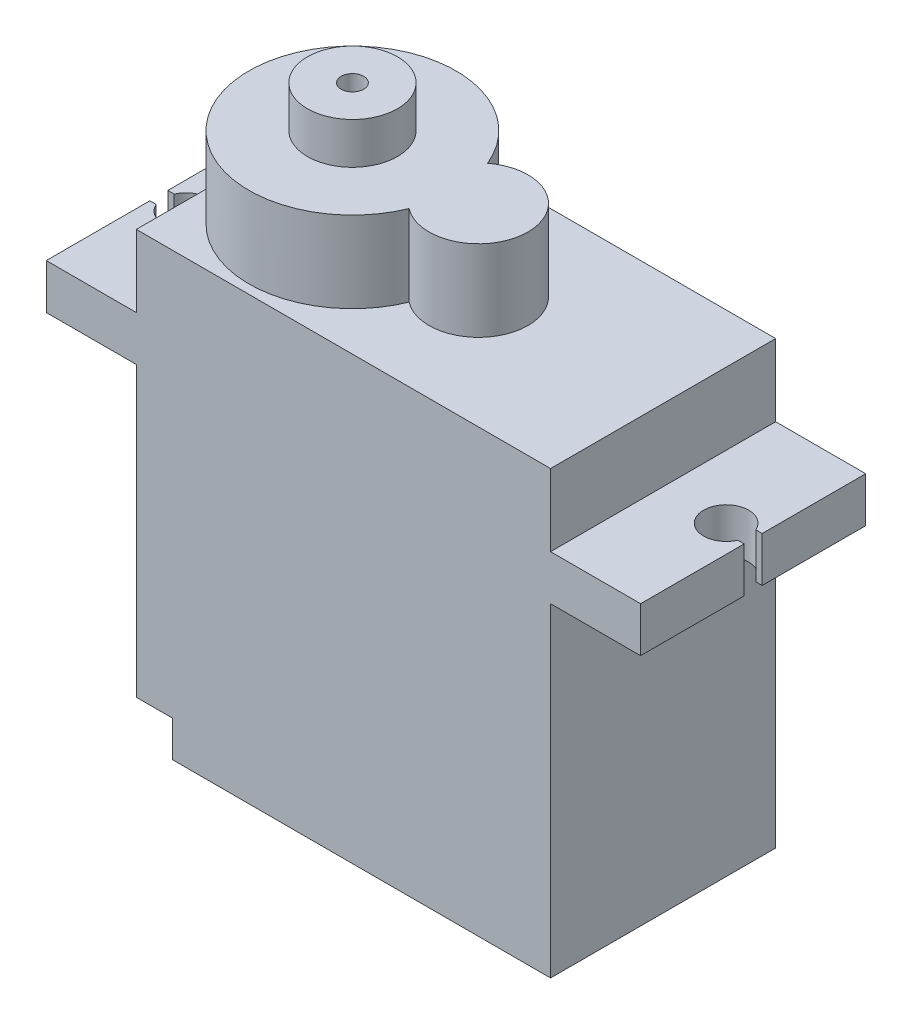
ISO-10303-21;
HEADER;
FILE_DESCRIPTION(('STEP AP214'),'2;1');
FILE_NAME('part.step','',(''),(''),'','','');
FILE_SCHEMA(('AUTOMOTIVE_DESIGN { 1 0 10303 214 1 1 1 1 }'));
ENDSEC;
DATA;
#1=APPLICATION_CONTEXT('core data for automotive mechanical design processes');
#2=APPLICATION_PROTOCOL_DEFINITION('international standard','automotive_design',2000,#1);
#3=PRODUCT_CONTEXT('',#1,'mechanical');
#4=PRODUCT('Part','Part','',(#3));
#5=PRODUCT_RELATED_PRODUCT_CATEGORY('part','',(#4));
#6=PRODUCT_DEFINITION_FORMATION('','',#4);
#7=PRODUCT_DEFINITION_CONTEXT('part definition',#1,'design');
#8=PRODUCT_DEFINITION('design','',#6,#7);
#9=PRODUCT_DEFINITION_SHAPE('','',#8);
#10=(LENGTH_UNIT() NAMED_UNIT(*) SI_UNIT(.MILLI.,.METRE.));
#11=(NAMED_UNIT(*) PLANE_ANGLE_UNIT() SI_UNIT($,.RADIAN.));
#12=(NAMED_UNIT(*) SI_UNIT($,.STERADIAN.) SOLID_ANGLE_UNIT());
#13=UNCERTAINTY_MEASURE_WITH_UNIT(LENGTH_MEASURE(1.E-05),#10,'distance_accuracy_value','');
#14=(GEOMETRIC_REPRESENTATION_CONTEXT(3) GLOBAL_UNCERTAINTY_ASSIGNED_CONTEXT((#13)) GLOBAL_UNIT_ASSIGNED_CONTEXT((#10,
#11,#12)) REPRESENTATION_CONTEXT('',''));
#15=CARTESIAN_POINT('',(0.,0.,0.));
#16=DIRECTION('',(0.,0.,1.));
#17=DIRECTION('',(1.,0.,0.));
#18=AXIS2_PLACEMENT_3D('',#15,#16,#17);
#19=CARTESIAN_POINT('',(-11.5,11.5,12.5));
#20=DIRECTION('',(0.,-1.,0.));
#21=DIRECTION('',(0.,0.,-1.));
#22=AXIS2_PLACEMENT_3D('',#19,#20,#21);
#23=PLANE('',#22);
#24=DIRECTION('',(1.,0.,0.));
#25=VECTOR('',#24,1.);
#26=CARTESIAN_POINT('',(-16.145643923739,11.5,5.75));
#27=LINE('',#26,#25);
#28=CARTESIAN_POINT('',(-16.5,11.5,5.75));
#29=VERTEX_POINT('',#28);
#30=CARTESIAN_POINT('',(-16.145643923739,11.5,5.75));
#31=VERTEX_POINT('',#30);
#32=EDGE_CURVE('E251',#29,#31,#27,.T.);
#33=ORIENTED_EDGE('',*,*,#32,.T.);
#34=CARTESIAN_POINT('',(-15.,11.5,6.25));
#35=DIRECTION('',(0.,-1.,0.));
#36=DIRECTION('',(0.,0.,1.));
#37=AXIS2_PLACEMENT_3D('',#34,#35,#36);
#38=CIRCLE('',#37,1.25);
#39=CARTESIAN_POINT('',(-16.145643923739,11.5,6.75));
#40=VERTEX_POINT('',#39);
#41=EDGE_CURVE('E246',#31,#40,#38,.T.);
#42=ORIENTED_EDGE('',*,*,#41,.T.);
#43=DIRECTION('',(-1.,0.,0.));
#44=VECTOR('',#43,1.);
#45=CARTESIAN_POINT('',(-16.145643923739,11.5,6.75));
#46=LINE('',#45,#44);
#47=CARTESIAN_POINT('',(-16.5,11.5,6.75));
#48=VERTEX_POINT('',#47);
#49=EDGE_CURVE('E254',#40,#48,#46,.T.);
#50=ORIENTED_EDGE('',*,*,#49,.T.);
#51=DIRECTION('',(0.,0.,-1.));
#52=VECTOR('',#51,1.);
#53=CARTESIAN_POINT('',(-16.5,11.5,12.5));
#54=LINE('',#53,#52);
#55=CARTESIAN_POINT('',(-16.5,11.5,12.5));
#56=VERTEX_POINT('',#55);
#57=EDGE_CURVE('E425',#56,#48,#54,.T.);
#58=ORIENTED_EDGE('',*,*,#57,.F.);
#59=DIRECTION('',(-1.,0.,0.));
#60=VECTOR('',#59,1.);
#61=CARTESIAN_POINT('',(-11.5,11.5,12.5));
#62=LINE('',#61,#60);
#63=CARTESIAN_POINT('',(-11.5,11.5,12.5));
#64=VERTEX_POINT('',#63);
#65=EDGE_CURVE('E383',#64,#56,#62,.T.);
#66=ORIENTED_EDGE('',*,*,#65,.F.);
#67=DIRECTION('',(0.,0.,-1.));
#68=VECTOR('',#67,1.);
#69=CARTESIAN_POINT('',(-11.5,11.5,12.5));
#70=LINE('',#69,#68);
#71=CARTESIAN_POINT('',(-11.5,11.5,0.));
#72=VERTEX_POINT('',#71);
#73=EDGE_CURVE('E427',#64,#72,#70,.T.);
#74=ORIENTED_EDGE('',*,*,#73,.T.);
#75=DIRECTION('',(-1.,0.,0.));
#76=VECTOR('',#75,1.);
#77=CARTESIAN_POINT('',(-11.5,11.5,0.));
#78=LINE('',#77,#76);
#79=CARTESIAN_POINT('',(-16.5,11.5,0.));
#80=VERTEX_POINT('',#79);
#81=EDGE_CURVE('E411',#72,#80,#78,.T.);
#82=ORIENTED_EDGE('',*,*,#81,.T.);
#83=EDGE_CURVE('E424',#29,#80,#54,.T.);
#84=ORIENTED_EDGE('',*,*,#83,.F.);
#85=EDGE_LOOP('',(#33,#42,#50,#58,#66,#74,#82,#84));
#86=FACE_BOUND('',#85,.T.);
#87=ADVANCED_FACE('F43',(#86),#23,.F.);
#88=CARTESIAN_POINT('',(-16.5,9.,12.5));
#89=DIRECTION('',(1.,0.,0.));
#90=DIRECTION('',(0.,0.,-1.));
#91=AXIS2_PLACEMENT_3D('',#88,#89,#90);
#92=PLANE('',#91);
#93=DIRECTION('',(0.,-1.,0.));
#94=VECTOR('',#93,1.);
#95=CARTESIAN_POINT('',(-16.5,9.,5.75));
#96=LINE('',#95,#94);
#97=CARTESIAN_POINT('',(-16.5,9.,5.75));
#98=VERTEX_POINT('',#97);
#99=EDGE_CURVE('E270',#29,#98,#96,.T.);
#100=ORIENTED_EDGE('',*,*,#99,.F.);
#101=ORIENTED_EDGE('',*,*,#83,.T.);
#102=DIRECTION('',(0.,-1.,0.));
#103=VECTOR('',#102,1.);
#104=CARTESIAN_POINT('',(-16.5,9.,0.));
#105=LINE('',#104,#103);
#106=CARTESIAN_POINT('',(-16.5,9.,0.));
#107=VERTEX_POINT('',#106);
#108=EDGE_CURVE('E414',#80,#107,#105,.T.);
#109=ORIENTED_EDGE('',*,*,#108,.T.);
#110=DIRECTION('',(0.,0.,-1.));
#111=VECTOR('',#110,1.);
#112=CARTESIAN_POINT('',(-16.5,9.,12.5));
#113=LINE('',#112,#111);
#114=EDGE_CURVE('E420',#98,#107,#113,.T.);
#115=ORIENTED_EDGE('',*,*,#114,.F.);
#116=EDGE_LOOP('',(#100,#101,#109,#115));
#117=FACE_BOUND('',#116,.T.);
#118=ADVANCED_FACE('F506',(#117),#92,.F.);
#119=DIRECTION('',(0.,1.,0.));
#120=VECTOR('',#119,1.);
#121=CARTESIAN_POINT('',(-16.5,9.,6.75));
#122=LINE('',#121,#120);
#123=CARTESIAN_POINT('',(-16.5,9.,6.75));
#124=VERTEX_POINT('',#123);
#125=EDGE_CURVE('E257',#124,#48,#122,.T.);
#126=ORIENTED_EDGE('',*,*,#125,.F.);
#127=CARTESIAN_POINT('',(-16.5,9.,12.5));
#128=VERTEX_POINT('',#127);
#129=EDGE_CURVE('E421',#128,#124,#113,.T.);
#130=ORIENTED_EDGE('',*,*,#129,.F.);
#131=DIRECTION('',(0.,-1.,0.));
#132=VECTOR('',#131,1.);
#133=CARTESIAN_POINT('',(-16.5,9.,12.5));
#134=LINE('',#133,#132);
#135=EDGE_CURVE('E385',#56,#128,#134,.T.);
#136=ORIENTED_EDGE('',*,*,#135,.F.);
#137=ORIENTED_EDGE('',*,*,#57,.T.);
#138=EDGE_LOOP('',(#126,#130,#136,#137));
#139=FACE_BOUND('',#138,.T.);
#140=ADVANCED_FACE('F480',(#139),#92,.F.);
#141=CARTESIAN_POINT('',(-11.5,9.,12.5));
#142=DIRECTION('',(0.,1.,0.));
#143=DIRECTION('',(0.,0.,1.));
#144=AXIS2_PLACEMENT_3D('',#141,#142,#143);
#145=PLANE('',#144);
#146=DIRECTION('',(1.,0.,0.));
#147=VECTOR('',#146,1.);
#148=CARTESIAN_POINT('',(-11.5,9.,5.75));
#149=LINE('',#148,#147);
#150=CARTESIAN_POINT('',(-16.145643923739,9.,5.75));
#151=VERTEX_POINT('',#150);
#152=EDGE_CURVE('E11',#98,#151,#149,.T.);
#153=ORIENTED_EDGE('',*,*,#152,.F.);
#154=ORIENTED_EDGE('',*,*,#114,.T.);
#155=DIRECTION('',(1.,0.,0.));
#156=VECTOR('',#155,1.);
#157=CARTESIAN_POINT('',(-11.5,9.,0.));
#158=LINE('',#157,#156);
#159=CARTESIAN_POINT('',(-11.5,9.,0.));
#160=VERTEX_POINT('',#159);
#161=EDGE_CURVE('E367',#107,#160,#158,.T.);
#162=ORIENTED_EDGE('',*,*,#161,.T.);
#163=DIRECTION('',(0.,0.,-1.));
#164=VECTOR('',#163,1.);
#165=CARTESIAN_POINT('',(-11.5,9.,12.5));
#166=LINE('',#165,#164);
#167=CARTESIAN_POINT('',(-11.5,9.,12.5));
#168=VERTEX_POINT('',#167);
#169=EDGE_CURVE('E389',#168,#160,#166,.T.);
#170=ORIENTED_EDGE('',*,*,#169,.F.);
#171=DIRECTION('',(1.,0.,0.));
#172=VECTOR('',#171,1.);
#173=CARTESIAN_POINT('',(-11.5,9.,12.5));
#174=LINE('',#173,#172);
#175=EDGE_CURVE('E387',#128,#168,#174,.T.);
#176=ORIENTED_EDGE('',*,*,#175,.F.);
#177=ORIENTED_EDGE('',*,*,#129,.T.);
#178=DIRECTION('',(-1.,0.,0.));
#179=VECTOR('',#178,1.);
#180=CARTESIAN_POINT('',(-11.5,9.,6.75));
#181=LINE('',#180,#179);
#182=CARTESIAN_POINT('',(-16.145643923739,9.,6.75));
#183=VERTEX_POINT('',#182);
#184=EDGE_CURVE('E476',#183,#124,#181,.T.);
#185=ORIENTED_EDGE('',*,*,#184,.F.);
#186=CARTESIAN_POINT('',(-15.,9.,6.25));
#187=DIRECTION('',(0.,1.,0.));
#188=DIRECTION('',(0.,0.,1.));
#189=AXIS2_PLACEMENT_3D('',#186,#187,#188);
#190=CIRCLE('',#189,1.25);
#191=EDGE_CURVE('E52',#151,#183,#190,.F.);
#192=ORIENTED_EDGE('',*,*,#191,.F.);
#193=EDGE_LOOP('',(#153,#154,#162,#170,#176,#177,#185,#192));
#194=FACE_BOUND('',#193,.T.);
#195=ADVANCED_FACE('F484',(#194),#145,.F.);
#196=CARTESIAN_POINT('',(16.5,9.,12.5));
#197=DIRECTION('',(-1.,0.,0.));
#198=DIRECTION('',(0.,0.,1.));
#199=AXIS2_PLACEMENT_3D('',#196,#197,#198);
#200=PLANE('',#199);
#201=DIRECTION('',(0.,0.,-1.));
#202=VECTOR('',#201,1.);
#203=CARTESIAN_POINT('',(16.5,9.,12.5));
#204=LINE('',#203,#202);
#205=CARTESIAN_POINT('',(16.5,9.,12.5));
#206=VERTEX_POINT('',#205);
#207=CARTESIAN_POINT('',(16.5,9.,6.75));
#208=VERTEX_POINT('',#207);
#209=EDGE_CURVE('E445',#206,#208,#204,.T.);
#210=ORIENTED_EDGE('',*,*,#209,.T.);
#211=DIRECTION('',(0.,1.,0.));
#212=VECTOR('',#211,1.);
#213=CARTESIAN_POINT('',(16.5,9.,6.75));
#214=LINE('',#213,#212);
#215=CARTESIAN_POINT('',(16.5,11.5,6.75));
#216=VERTEX_POINT('',#215);
#217=EDGE_CURVE('E288',#208,#216,#214,.T.);
#218=ORIENTED_EDGE('',*,*,#217,.T.);
#219=DIRECTION('',(0.,0.,-1.));
#220=VECTOR('',#219,1.);
#221=CARTESIAN_POINT('',(16.5,11.5,12.5));
#222=LINE('',#221,#220);
#223=CARTESIAN_POINT('',(16.5,11.5,12.5));
#224=VERTEX_POINT('',#223);
#225=EDGE_CURVE('E441',#224,#216,#222,.T.);
#226=ORIENTED_EDGE('',*,*,#225,.F.);
#227=DIRECTION('',(0.,1.,0.));
#228=VECTOR('',#227,1.);
#229=CARTESIAN_POINT('',(16.5,9.,12.5));
#230=LINE('',#229,#228);
#231=EDGE_CURVE('E373',#206,#224,#230,.T.);
#232=ORIENTED_EDGE('',*,*,#231,.F.);
#233=EDGE_LOOP('',(#210,#218,#226,#232));
#234=FACE_BOUND('',#233,.T.);
#235=ADVANCED_FACE('F553',(#234),#200,.F.);
#236=CARTESIAN_POINT('',(-9.50000000000001,-9.,12.5));
#237=DIRECTION('',(0.707106781186549,0.707106781186546,0.));
#238=DIRECTION('',(0.,0.,-1.));
#239=AXIS2_PLACEMENT_3D('',#236,#237,#238);
#240=PLANE('',#239);
#241=DIRECTION('',(0.707106781186546,-0.707106781186549,0.));
#242=VECTOR('',#241,1.);
#243=CARTESIAN_POINT('',(-9.50000000000001,-9.,2.));
#244=LINE('',#243,#242);
#245=CARTESIAN_POINT('',(-9.50000000000001,-9.,2.));
#246=VERTEX_POINT('',#245);
#247=CARTESIAN_POINT('',(-11.5,-7.,2.));
#248=VERTEX_POINT('',#247);
#249=EDGE_CURVE('E472',#246,#248,#244,.F.);
#250=ORIENTED_EDGE('',*,*,#249,.F.);
#251=DIRECTION('',(0.,0.,-1.));
#252=VECTOR('',#251,1.);
#253=CARTESIAN_POINT('',(-9.50000000000001,-9.,12.5));
#254=LINE('',#253,#252);
#255=CARTESIAN_POINT('',(-9.50000000000001,-9.,4.35));
#256=VERTEX_POINT('',#255);
#257=EDGE_CURVE('E459',#256,#246,#254,.T.);
#258=ORIENTED_EDGE('',*,*,#257,.F.);
#259=DIRECTION('',(-0.707106781186546,0.707106781186549,0.));
#260=VECTOR('',#259,1.);
#261=CARTESIAN_POINT('',(-9.50000000000001,-9.,4.35));
#262=LINE('',#261,#260);
#263=CARTESIAN_POINT('',(-11.5,-7.,4.35));
#264=VERTEX_POINT('',#263);
#265=EDGE_CURVE('E466',#264,#256,#262,.F.);
#266=ORIENTED_EDGE('',*,*,#265,.F.);
#267=DIRECTION('',(0.,0.,1.));
#268=VECTOR('',#267,1.);
#269=CARTESIAN_POINT('',(-11.5,-7.00000000000001,12.5));
#270=LINE('',#269,#268);
#271=EDGE_CURVE('E464',#248,#264,#270,.T.);
#272=ORIENTED_EDGE('',*,*,#271,.F.);
#273=EDGE_LOOP('',(#250,#258,#266,#272));
#274=FACE_BOUND('',#273,.T.);
#275=ADVANCED_FACE('F694',(#274),#240,.F.);
#276=CARTESIAN_POINT('',(-11.5,9.,12.5));
#277=DIRECTION('',(1.,0.,0.));
#278=DIRECTION('',(0.,1.,0.));
#279=AXIS2_PLACEMENT_3D('',#276,#277,#278);
#280=PLANE('',#279);
#281=DIRECTION('',(0.,-1.,0.));
#282=VECTOR('',#281,1.);
#283=CARTESIAN_POINT('',(-11.5,9.,0.));
#284=LINE('',#283,#282);
#285=CARTESIAN_POINT('',(-11.5,-7.,0.));
#286=VERTEX_POINT('',#285);
#287=EDGE_CURVE('E362',#160,#286,#284,.T.);
#288=ORIENTED_EDGE('',*,*,#287,.T.);
#289=EDGE_CURVE('E460',#286,#248,#270,.T.);
#290=ORIENTED_EDGE('',*,*,#289,.T.);
#291=ORIENTED_EDGE('',*,*,#271,.T.);
#292=DIRECTION('',(0.,0.,-1.));
#293=VECTOR('',#292,1.);
#294=CARTESIAN_POINT('',(-11.5,-7.,8.15));
#295=LINE('',#294,#293);
#296=CARTESIAN_POINT('',(-11.5,-7.,8.15));
#297=VERTEX_POINT('',#296);
#298=EDGE_CURVE('E335',#297,#264,#295,.T.);
#299=ORIENTED_EDGE('',*,*,#298,.F.);
#300=CARTESIAN_POINT('',(-11.5,-7.,10.5));
#301=VERTEX_POINT('',#300);
#302=EDGE_CURVE('E457',#297,#301,#270,.T.);
#303=ORIENTED_EDGE('',*,*,#302,.T.);
#304=DIRECTION('',(0.,0.,-1.));
#305=VECTOR('',#304,1.);
#306=CARTESIAN_POINT('',(-11.5,-7.,12.5));
#307=LINE('',#306,#305);
#308=CARTESIAN_POINT('',(-11.5,-7.,12.5));
#309=VERTEX_POINT('',#308);
#310=EDGE_CURVE('E313',#309,#301,#307,.T.);
#311=ORIENTED_EDGE('',*,*,#310,.F.);
#312=DIRECTION('',(0.,-1.,0.));
#313=VECTOR('',#312,1.);
#314=CARTESIAN_POINT('',(-11.5,9.,12.5));
#315=LINE('',#314,#313);
#316=EDGE_CURVE('E363',#168,#309,#315,.T.);
#317=ORIENTED_EDGE('',*,*,#316,.F.);
#318=ORIENTED_EDGE('',*,*,#169,.T.);
#319=EDGE_LOOP('',(#288,#290,#291,#299,#303,#311,#317,#318));
#320=FACE_BOUND('',#319,.T.);
#321=ADVANCED_FACE('F510',(#320),#280,.F.);
#322=CARTESIAN_POINT('',(11.5,-9.,12.5));
#323=DIRECTION('',(0.,1.,0.));
#324=DIRECTION('',(-1.,0.,0.));
#325=AXIS2_PLACEMENT_3D('',#322,#323,#324);
#326=PLANE('',#325);
#327=DIRECTION('',(1.,0.,0.));
#328=VECTOR('',#327,1.);
#329=CARTESIAN_POINT('',(11.5,-9.,12.5));
#330=LINE('',#329,#328);
#331=CARTESIAN_POINT('',(-9.50000000000001,-9.,12.5));
#332=VERTEX_POINT('',#331);
#333=CARTESIAN_POINT('',(11.5,-9.,12.5));
#334=VERTEX_POINT('',#333);
#335=EDGE_CURVE('E366',#332,#334,#330,.T.);
#336=ORIENTED_EDGE('',*,*,#335,.F.);
#337=CARTESIAN_POINT('',(-9.50000000000001,-9.,10.5));
#338=VERTEX_POINT('',#337);
#339=EDGE_CURVE('E454',#332,#338,#254,.T.);
#340=ORIENTED_EDGE('',*,*,#339,.T.);
#341=CARTESIAN_POINT('',(-9.50000000000001,-9.,8.15));
#342=VERTEX_POINT('',#341);
#343=EDGE_CURVE('E458',#338,#342,#254,.T.);
#344=ORIENTED_EDGE('',*,*,#343,.T.);
#345=DIRECTION('',(0.,0.,1.));
#346=VECTOR('',#345,1.);
#347=CARTESIAN_POINT('',(-9.50000000000001,-9.,8.15));
#348=LINE('',#347,#346);
#349=EDGE_CURVE('E294',#256,#342,#348,.T.);
#350=ORIENTED_EDGE('',*,*,#349,.F.);
#351=ORIENTED_EDGE('',*,*,#257,.T.);
#352=DIRECTION('',(0.,0.,1.));
#353=VECTOR('',#352,1.);
#354=CARTESIAN_POINT('',(-9.50000000000001,-9.,0.));
#355=LINE('',#354,#353);
#356=CARTESIAN_POINT('',(-9.50000000000001,-9.,0.));
#357=VERTEX_POINT('',#356);
#358=EDGE_CURVE('E299',#357,#246,#355,.T.);
#359=ORIENTED_EDGE('',*,*,#358,.F.);
#360=DIRECTION('',(1.,0.,0.));
#361=VECTOR('',#360,1.);
#362=CARTESIAN_POINT('',(11.5,-9.,0.));
#363=LINE('',#362,#361);
#364=CARTESIAN_POINT('',(11.5,-9.,0.));
#365=VERTEX_POINT('',#364);
#366=EDGE_CURVE('E392',#357,#365,#363,.T.);
#367=ORIENTED_EDGE('',*,*,#366,.T.);
#368=DIRECTION('',(0.,0.,-1.));
#369=VECTOR('',#368,1.);
#370=CARTESIAN_POINT('',(11.5,-9.,12.5));
#371=LINE('',#370,#369);
#372=EDGE_CURVE('E451',#334,#365,#371,.T.);
#373=ORIENTED_EDGE('',*,*,#372,.F.);
#374=EDGE_LOOP('',(#336,#340,#344,#350,#351,#359,#367,#373));
#375=FACE_BOUND('',#374,.T.);
#376=ADVANCED_FACE('F539',(#375),#326,.F.);
#377=CARTESIAN_POINT('',(11.5,9.,12.5));
#378=DIRECTION('',(-1.,0.,0.));
#379=DIRECTION('',(0.,-1.,0.));
#380=AXIS2_PLACEMENT_3D('',#377,#378,#379);
#381=PLANE('',#380);
#382=DIRECTION('',(0.,1.,0.));
#383=VECTOR('',#382,1.);
#384=CARTESIAN_POINT('',(11.5,9.,0.));
#385=LINE('',#384,#383);
#386=CARTESIAN_POINT('',(11.5,9.,0.));
#387=VERTEX_POINT('',#386);
#388=EDGE_CURVE('E394',#365,#387,#385,.T.);
#389=ORIENTED_EDGE('',*,*,#388,.T.);
#390=DIRECTION('',(0.,0.,-1.));
#391=VECTOR('',#390,1.);
#392=CARTESIAN_POINT('',(11.5,9.,12.5));
#393=LINE('',#392,#391);
#394=CARTESIAN_POINT('',(11.5,9.,12.5));
#395=VERTEX_POINT('',#394);
#396=EDGE_CURVE('E448',#395,#387,#393,.T.);
#397=ORIENTED_EDGE('',*,*,#396,.F.);
#398=DIRECTION('',(0.,1.,0.));
#399=VECTOR('',#398,1.);
#400=CARTESIAN_POINT('',(11.5,9.,12.5));
#401=LINE('',#400,#399);
#402=EDGE_CURVE('E369',#334,#395,#401,.T.);
#403=ORIENTED_EDGE('',*,*,#402,.F.);
#404=ORIENTED_EDGE('',*,*,#372,.T.);
#405=EDGE_LOOP('',(#389,#397,#403,#404));
#406=FACE_BOUND('',#405,.T.);
#407=ADVANCED_FACE('F545',(#406),#381,.F.);
#408=CARTESIAN_POINT('',(11.5,9.,12.5));
#409=DIRECTION('',(0.,1.,0.));
#410=DIRECTION('',(-1.,0.,0.));
#411=AXIS2_PLACEMENT_3D('',#408,#409,#410);
#412=PLANE('',#411);
#413=CARTESIAN_POINT('',(15.,9.,6.25));
#414=DIRECTION('',(0.,1.,0.));
#415=DIRECTION('',(-1.,0.,0.));
#416=AXIS2_PLACEMENT_3D('',#413,#414,#415);
#417=CIRCLE('',#416,1.25);
#418=CARTESIAN_POINT('',(16.145643923739,9.,5.75));
#419=VERTEX_POINT('',#418);
#420=CARTESIAN_POINT('',(16.145643923739,9.,6.75));
#421=VERTEX_POINT('',#420);
#422=EDGE_CURVE('E285',#419,#421,#417,.T.);
#423=ORIENTED_EDGE('',*,*,#422,.T.);
#424=DIRECTION('',(1.,0.,0.));
#425=VECTOR('',#424,1.);
#426=CARTESIAN_POINT('',(11.5,9.,6.75));
#427=LINE('',#426,#425);
#428=EDGE_CURVE('E291',#421,#208,#427,.T.);
#429=ORIENTED_EDGE('',*,*,#428,.T.);
#430=ORIENTED_EDGE('',*,*,#209,.F.);
#431=DIRECTION('',(1.,0.,0.));
#432=VECTOR('',#431,1.);
#433=CARTESIAN_POINT('',(11.5,9.,12.5));
#434=LINE('',#433,#432);
#435=EDGE_CURVE('E371',#395,#206,#434,.T.);
#436=ORIENTED_EDGE('',*,*,#435,.F.);
#437=ORIENTED_EDGE('',*,*,#396,.T.);
#438=DIRECTION('',(1.,0.,0.));
#439=VECTOR('',#438,1.);
#440=CARTESIAN_POINT('',(11.5,9.,0.));
#441=LINE('',#440,#439);
#442=CARTESIAN_POINT('',(16.5,9.,0.));
#443=VERTEX_POINT('',#442);
#444=EDGE_CURVE('E396',#387,#443,#441,.T.);
#445=ORIENTED_EDGE('',*,*,#444,.T.);
#446=CARTESIAN_POINT('',(16.5,9.,5.75));
#447=VERTEX_POINT('',#446);
#448=EDGE_CURVE('E444',#447,#443,#204,.T.);
#449=ORIENTED_EDGE('',*,*,#448,.F.);
#450=DIRECTION('',(-1.,0.,0.));
#451=VECTOR('',#450,1.);
#452=CARTESIAN_POINT('',(11.5,9.,5.75));
#453=LINE('',#452,#451);
#454=EDGE_CURVE('E282',#447,#419,#453,.T.);
#455=ORIENTED_EDGE('',*,*,#454,.T.);
#456=EDGE_LOOP('',(#423,#429,#430,#436,#437,#445,#449,#455));
#457=FACE_BOUND('',#456,.T.);
#458=ADVANCED_FACE('F551',(#457),#412,.F.);
#459=CARTESIAN_POINT('',(16.5,11.5,5.75));
#460=VERTEX_POINT('',#459);
#461=CARTESIAN_POINT('',(16.5,11.5,0.));
#462=VERTEX_POINT('',#461);
#463=EDGE_CURVE('E440',#460,#462,#222,.T.);
#464=ORIENTED_EDGE('',*,*,#463,.F.);
#465=DIRECTION('',(0.,-1.,0.));
#466=VECTOR('',#465,1.);
#467=CARTESIAN_POINT('',(16.5,9.,5.75));
#468=LINE('',#467,#466);
#469=EDGE_CURVE('E67',#460,#447,#468,.T.);
#470=ORIENTED_EDGE('',*,*,#469,.T.);
#471=ORIENTED_EDGE('',*,*,#448,.T.);
#472=DIRECTION('',(0.,1.,0.));
#473=VECTOR('',#472,1.);
#474=CARTESIAN_POINT('',(16.5,9.,0.));
#475=LINE('',#474,#473);
#476=EDGE_CURVE('E399',#443,#462,#475,.T.);
#477=ORIENTED_EDGE('',*,*,#476,.T.);
#478=EDGE_LOOP('',(#464,#470,#471,#477));
#479=FACE_BOUND('',#478,.T.);
#480=ADVANCED_FACE('F701',(#479),#200,.F.);
#481=CARTESIAN_POINT('',(11.5,11.5,12.5));
#482=DIRECTION('',(0.,-1.,0.));
#483=DIRECTION('',(0.,0.,-1.));
#484=AXIS2_PLACEMENT_3D('',#481,#482,#483);
#485=PLANE('',#484);
#486=ORIENTED_EDGE('',*,*,#225,.T.);
#487=DIRECTION('',(1.,0.,0.));
#488=VECTOR('',#487,1.);
#489=CARTESIAN_POINT('',(16.145643923739,11.5,6.75));
#490=LINE('',#489,#488);
#491=CARTESIAN_POINT('',(16.145643923739,11.5,6.75));
#492=VERTEX_POINT('',#491);
#493=EDGE_CURVE('E275',#492,#216,#490,.T.);
#494=ORIENTED_EDGE('',*,*,#493,.F.);
#495=CARTESIAN_POINT('',(15.,11.5,6.25));
#496=DIRECTION('',(0.,1.,0.));
#497=DIRECTION('',(0.,0.,1.));
#498=AXIS2_PLACEMENT_3D('',#495,#496,#497);
#499=CIRCLE('',#498,1.25);
#500=CARTESIAN_POINT('',(16.145643923739,11.5,5.75));
#501=VERTEX_POINT('',#500);
#502=EDGE_CURVE('E272',#501,#492,#499,.T.);
#503=ORIENTED_EDGE('',*,*,#502,.F.);
#504=DIRECTION('',(1.,0.,0.));
#505=VECTOR('',#504,1.);
#506=CARTESIAN_POINT('',(11.5,11.5,5.75));
#507=LINE('',#506,#505);
#508=EDGE_CURVE('E474',#501,#460,#507,.T.);
#509=ORIENTED_EDGE('',*,*,#508,.T.);
#510=ORIENTED_EDGE('',*,*,#463,.T.);
#511=DIRECTION('',(-1.,0.,0.));
#512=VECTOR('',#511,1.);
#513=CARTESIAN_POINT('',(11.5,11.5,0.));
#514=LINE('',#513,#512);
#515=CARTESIAN_POINT('',(11.5,11.5,0.));
#516=VERTEX_POINT('',#515);
#517=EDGE_CURVE('E402',#462,#516,#514,.T.);
#518=ORIENTED_EDGE('',*,*,#517,.T.);
#519=DIRECTION('',(0.,0.,-1.));
#520=VECTOR('',#519,1.);
#521=CARTESIAN_POINT('',(11.5,11.5,12.5));
#522=LINE('',#521,#520);
#523=CARTESIAN_POINT('',(11.5,11.5,12.5));
#524=VERTEX_POINT('',#523);
#525=EDGE_CURVE('E437',#524,#516,#522,.T.);
#526=ORIENTED_EDGE('',*,*,#525,.F.);
#527=DIRECTION('',(-1.,0.,0.));
#528=VECTOR('',#527,1.);
#529=CARTESIAN_POINT('',(11.5,11.5,12.5));
#530=LINE('',#529,#528);
#531=EDGE_CURVE('E375',#224,#524,#530,.T.);
#532=ORIENTED_EDGE('',*,*,#531,.F.);
#533=EDGE_LOOP('',(#486,#494,#503,#509,#510,#518,#526,#532));
#534=FACE_BOUND('',#533,.T.);
#535=ADVANCED_FACE('F558',(#534),#485,.F.);
#536=CARTESIAN_POINT('',(11.5,11.5,12.5));
#537=DIRECTION('',(-1.,0.,0.));
#538=DIRECTION('',(0.,0.,1.));
#539=AXIS2_PLACEMENT_3D('',#536,#537,#538);
#540=PLANE('',#539);
#541=DIRECTION('',(0.,1.,0.));
#542=VECTOR('',#541,1.);
#543=CARTESIAN_POINT('',(11.5,11.5,0.));
#544=LINE('',#543,#542);
#545=CARTESIAN_POINT('',(11.5,15.5,0.));
#546=VERTEX_POINT('',#545);
#547=EDGE_CURVE('E404',#516,#546,#544,.T.);
#548=ORIENTED_EDGE('',*,*,#547,.T.);
#549=DIRECTION('',(0.,0.,-1.));
#550=VECTOR('',#549,1.);
#551=CARTESIAN_POINT('',(11.5,15.5,12.5));
#552=LINE('',#551,#550);
#553=CARTESIAN_POINT('',(11.5,15.5,12.5));
#554=VERTEX_POINT('',#553);
#555=EDGE_CURVE('E434',#554,#546,#552,.T.);
#556=ORIENTED_EDGE('',*,*,#555,.F.);
#557=DIRECTION('',(0.,1.,0.));
#558=VECTOR('',#557,1.);
#559=CARTESIAN_POINT('',(11.5,11.5,12.5));
#560=LINE('',#559,#558);
#561=EDGE_CURVE('E377',#524,#554,#560,.T.);
#562=ORIENTED_EDGE('',*,*,#561,.F.);
#563=ORIENTED_EDGE('',*,*,#525,.T.);
#564=EDGE_LOOP('',(#548,#556,#562,#563));
#565=FACE_BOUND('',#564,.T.);
#566=ADVANCED_FACE('F564',(#565),#540,.F.);
#567=CARTESIAN_POINT('',(-11.5,15.5,12.5));
#568=DIRECTION('',(0.,-1.,0.));
#569=DIRECTION('',(0.,0.,-1.));
#570=AXIS2_PLACEMENT_3D('',#567,#568,#569);
#571=PLANE('',#570);
#572=CARTESIAN_POINT('',(1.25,15.5,6.25));
#573=DIRECTION('',(0.,1.,0.));
#574=DIRECTION('',(0.,0.,1.));
#575=AXIS2_PLACEMENT_3D('',#572,#573,#574);
#576=CIRCLE('',#575,2.75);
#577=CARTESIAN_POINT('',(-0.42857142857143,15.5,8.42827866885384));
#578=VERTEX_POINT('',#577);
#579=CARTESIAN_POINT('',(-0.42857142857143,15.5,4.07172133114616));
#580=VERTEX_POINT('',#579);
#581=EDGE_CURVE('E311',#578,#580,#576,.T.);
#582=ORIENTED_EDGE('',*,*,#581,.F.);
#583=CARTESIAN_POINT('',(-5.75,15.5,6.25));
#584=DIRECTION('',(0.,1.,0.));
#585=DIRECTION('',(0.,0.,1.));
#586=AXIS2_PLACEMENT_3D('',#583,#584,#585);
#587=CIRCLE('',#586,5.75);
#588=CARTESIAN_POINT('',(-11.5,15.5,6.25));
#589=VERTEX_POINT('',#588);
#590=EDGE_CURVE('E356',#589,#578,#587,.T.);
#591=ORIENTED_EDGE('',*,*,#590,.F.);
#592=DIRECTION('',(0.,0.,-1.));
#593=VECTOR('',#592,1.);
#594=CARTESIAN_POINT('',(-11.5,15.5,12.5));
#595=LINE('',#594,#593);
#596=CARTESIAN_POINT('',(-11.5,15.5,12.5));
#597=VERTEX_POINT('',#596);
#598=EDGE_CURVE('E431',#597,#589,#595,.T.);
#599=ORIENTED_EDGE('',*,*,#598,.F.);
#600=DIRECTION('',(-1.,0.,0.));
#601=VECTOR('',#600,1.);
#602=CARTESIAN_POINT('',(-11.5,15.5,12.5));
#603=LINE('',#602,#601);
#604=EDGE_CURVE('E379',#554,#597,#603,.T.);
#605=ORIENTED_EDGE('',*,*,#604,.F.);
#606=ORIENTED_EDGE('',*,*,#555,.T.);
#607=DIRECTION('',(-1.,0.,0.));
#608=VECTOR('',#607,1.);
#609=CARTESIAN_POINT('',(-11.5,15.5,0.));
#610=LINE('',#609,#608);
#611=CARTESIAN_POINT('',(-11.5,15.5,0.));
#612=VERTEX_POINT('',#611);
#613=EDGE_CURVE('E406',#546,#612,#610,.T.);
#614=ORIENTED_EDGE('',*,*,#613,.T.);
#615=EDGE_CURVE('E430',#589,#612,#595,.T.);
#616=ORIENTED_EDGE('',*,*,#615,.F.);
#617=EDGE_CURVE('E349',#580,#589,#587,.T.);
#618=ORIENTED_EDGE('',*,*,#617,.F.);
#619=EDGE_LOOP('',(#582,#591,#599,#605,#606,#614,#616,#618));
#620=FACE_BOUND('',#619,.T.);
#621=ADVANCED_FACE('F567',(#620),#571,.F.);
#622=CARTESIAN_POINT('',(-11.5,11.5,12.5));
#623=DIRECTION('',(1.,0.,0.));
#624=DIRECTION('',(0.,0.,-1.));
#625=AXIS2_PLACEMENT_3D('',#622,#623,#624);
#626=PLANE('',#625);
#627=DIRECTION('',(0.,-1.,0.));
#628=VECTOR('',#627,1.);
#629=CARTESIAN_POINT('',(-11.5,11.5,0.));
#630=LINE('',#629,#628);
#631=EDGE_CURVE('E409',#612,#72,#630,.T.);
#632=ORIENTED_EDGE('',*,*,#631,.T.);
#633=ORIENTED_EDGE('',*,*,#73,.F.);
#634=DIRECTION('',(0.,-1.,0.));
#635=VECTOR('',#634,1.);
#636=CARTESIAN_POINT('',(-11.5,11.5,12.5));
#637=LINE('',#636,#635);
#638=EDGE_CURVE('E381',#597,#64,#637,.T.);
#639=ORIENTED_EDGE('',*,*,#638,.F.);
#640=ORIENTED_EDGE('',*,*,#598,.T.);
#641=ORIENTED_EDGE('',*,*,#615,.T.);
#642=EDGE_LOOP('',(#632,#633,#639,#640,#641));
#643=FACE_BOUND('',#642,.T.);
#644=ADVANCED_FACE('F570',(#643),#626,.F.);
#645=CARTESIAN_POINT('',(0.,0.,12.5));
#646=DIRECTION('',(0.,0.,-1.));
#647=DIRECTION('',(-1.,0.,0.));
#648=AXIS2_PLACEMENT_3D('',#645,#646,#647);
#649=PLANE('',#648);
#650=DIRECTION('',(-1.,0.,0.));
#651=VECTOR('',#650,1.);
#652=CARTESIAN_POINT('',(-11.5,-7.,12.5));
#653=LINE('',#652,#651);
#654=CARTESIAN_POINT('',(-9.50000000000001,-7.,12.5));
#655=VERTEX_POINT('',#654);
#656=EDGE_CURVE('E323',#655,#309,#653,.T.);
#657=ORIENTED_EDGE('',*,*,#656,.F.);
#658=DIRECTION('',(0.,-1.,0.));
#659=VECTOR('',#658,1.);
#660=CARTESIAN_POINT('',(-9.50000000000001,-7.,12.5));
#661=LINE('',#660,#659);
#662=EDGE_CURVE('E308',#655,#332,#661,.T.);
#663=ORIENTED_EDGE('',*,*,#662,.T.);
#664=ORIENTED_EDGE('',*,*,#335,.T.);
#665=ORIENTED_EDGE('',*,*,#402,.T.);
#666=ORIENTED_EDGE('',*,*,#435,.T.);
#667=ORIENTED_EDGE('',*,*,#231,.T.);
#668=ORIENTED_EDGE('',*,*,#531,.T.);
#669=ORIENTED_EDGE('',*,*,#561,.T.);
#670=ORIENTED_EDGE('',*,*,#604,.T.);
#671=ORIENTED_EDGE('',*,*,#638,.T.);
#672=ORIENTED_EDGE('',*,*,#65,.T.);
#673=ORIENTED_EDGE('',*,*,#135,.T.);
#674=ORIENTED_EDGE('',*,*,#175,.T.);
#675=ORIENTED_EDGE('',*,*,#316,.T.);
#676=EDGE_LOOP('',(#657,#663,#664,#665,#666,#667,#668,#669,#670,#671,#672,#673,#674,#675));
#677=FACE_BOUND('',#676,.T.);
#678=ADVANCED_FACE('F489',(#677),#649,.F.);
#679=CARTESIAN_POINT('',(0.,0.,0.));
#680=DIRECTION('',(0.,0.,-1.));
#681=DIRECTION('',(-1.,0.,0.));
#682=AXIS2_PLACEMENT_3D('',#679,#680,#681);
#683=PLANE('',#682);
#684=DIRECTION('',(0.,-1.,0.));
#685=VECTOR('',#684,1.);
#686=CARTESIAN_POINT('',(-9.50000000000001,-7.,0.));
#687=LINE('',#686,#685);
#688=CARTESIAN_POINT('',(-9.50000000000001,-7.,0.));
#689=VERTEX_POINT('',#688);
#690=EDGE_CURVE('E305',#689,#357,#687,.T.);
#691=ORIENTED_EDGE('',*,*,#690,.F.);
#692=DIRECTION('',(1.,0.,0.));
#693=VECTOR('',#692,1.);
#694=CARTESIAN_POINT('',(-11.5,-7.,0.));
#695=LINE('',#694,#693);
#696=EDGE_CURVE('E295',#286,#689,#695,.T.);
#697=ORIENTED_EDGE('',*,*,#696,.F.);
#698=ORIENTED_EDGE('',*,*,#287,.F.);
#699=ORIENTED_EDGE('',*,*,#161,.F.);
#700=ORIENTED_EDGE('',*,*,#108,.F.);
#701=ORIENTED_EDGE('',*,*,#81,.F.);
#702=ORIENTED_EDGE('',*,*,#631,.F.);
#703=ORIENTED_EDGE('',*,*,#613,.F.);
#704=ORIENTED_EDGE('',*,*,#547,.F.);
#705=ORIENTED_EDGE('',*,*,#517,.F.);
#706=ORIENTED_EDGE('',*,*,#476,.F.);
#707=ORIENTED_EDGE('',*,*,#444,.F.);
#708=ORIENTED_EDGE('',*,*,#388,.F.);
#709=ORIENTED_EDGE('',*,*,#366,.F.);
#710=EDGE_LOOP('',(#691,#697,#698,#699,#700,#701,#702,#703,#704,#705,#706,#707,#708,#709));
#711=FACE_BOUND('',#710,.T.);
#712=ADVANCED_FACE('F499',(#711),#683,.T.);
#713=CARTESIAN_POINT('',(1.25,20.,6.25));
#714=DIRECTION('',(0.,-1.,0.));
#715=DIRECTION('',(0.,0.,-1.));
#716=AXIS2_PLACEMENT_3D('',#713,#714,#715);
#717=CYLINDRICAL_SURFACE('',#716,2.75);
#718=ORIENTED_EDGE('',*,*,#581,.T.);
#719=DIRECTION('',(0.,-1.,0.));
#720=VECTOR('',#719,1.);
#721=CARTESIAN_POINT('',(-0.42857142857143,20.,4.07172133114616));
#722=LINE('',#721,#720);
#723=CARTESIAN_POINT('',(-0.42857142857143,20.,4.07172133114616));
#724=VERTEX_POINT('',#723);
#725=EDGE_CURVE('E359',#724,#580,#722,.T.);
#726=ORIENTED_EDGE('',*,*,#725,.F.);
#727=CARTESIAN_POINT('',(1.25,20.,6.25));
#728=DIRECTION('',(0.,1.,0.));
#729=DIRECTION('',(0.,0.,1.));
#730=AXIS2_PLACEMENT_3D('',#727,#728,#729);
#731=CIRCLE('',#730,2.75);
#732=CARTESIAN_POINT('',(-0.42857142857143,20.,8.42827866885384));
#733=VERTEX_POINT('',#732);
#734=EDGE_CURVE('E345',#733,#724,#731,.T.);
#735=ORIENTED_EDGE('',*,*,#734,.F.);
#736=DIRECTION('',(0.,-1.,0.));
#737=VECTOR('',#736,1.);
#738=CARTESIAN_POINT('',(-0.42857142857143,20.,8.42827866885384));
#739=LINE('',#738,#737);
#740=EDGE_CURVE('E351',#733,#578,#739,.T.);
#741=ORIENTED_EDGE('',*,*,#740,.T.);
#742=EDGE_LOOP('',(#718,#726,#735,#741));
#743=FACE_BOUND('',#742,.T.);
#744=ADVANCED_FACE('F589',(#743),#717,.T.);
#745=CARTESIAN_POINT('',(-5.75,20.,6.25));
#746=DIRECTION('',(0.,-1.,0.));
#747=DIRECTION('',(0.,0.,-1.));
#748=AXIS2_PLACEMENT_3D('',#745,#746,#747);
#749=CYLINDRICAL_SURFACE('',#748,5.75);
#750=ORIENTED_EDGE('',*,*,#617,.T.);
#751=ORIENTED_EDGE('',*,*,#590,.T.);
#752=ORIENTED_EDGE('',*,*,#740,.F.);
#753=CARTESIAN_POINT('',(-5.75,20.,6.25));
#754=DIRECTION('',(0.,1.,0.));
#755=DIRECTION('',(0.,0.,1.));
#756=AXIS2_PLACEMENT_3D('',#753,#754,#755);
#757=CIRCLE('',#756,5.75);
#758=EDGE_CURVE('E348',#724,#733,#757,.T.);
#759=ORIENTED_EDGE('',*,*,#758,.F.);
#760=ORIENTED_EDGE('',*,*,#725,.T.);
#761=EDGE_LOOP('',(#750,#751,#752,#759,#760));
#762=FACE_BOUND('',#761,.T.);
#763=ADVANCED_FACE('F593',(#762),#749,.T.);
#764=CARTESIAN_POINT('',(-2.25,20.,6.25));
#765=DIRECTION('',(0.,1.,0.));
#766=DIRECTION('',(0.,0.,1.));
#767=AXIS2_PLACEMENT_3D('',#764,#765,#766);
#768=PLANE('',#767);
#769=CARTESIAN_POINT('',(-5.75,20.,6.25));
#770=DIRECTION('',(0.,1.,0.));
#771=DIRECTION('',(0.,0.,1.));
#772=AXIS2_PLACEMENT_3D('',#769,#770,#771);
#773=CIRCLE('',#772,2.5);
#774=CARTESIAN_POINT('',(-5.75,20.,8.75));
#775=VERTEX_POINT('',#774);
#776=EDGE_CURVE('E672',#775,#775,#773,.T.);
#777=ORIENTED_EDGE('',*,*,#776,.F.);
#778=EDGE_LOOP('',(#777));
#779=FACE_BOUND('',#778,.T.);
#780=ORIENTED_EDGE('',*,*,#734,.T.);
#781=ORIENTED_EDGE('',*,*,#758,.T.);
#782=EDGE_LOOP('',(#780,#781));
#783=FACE_BOUND('',#782,.T.);
#784=ADVANCED_FACE('F597',(#779,#783),#768,.T.);
#785=DIRECTION('',(-0.707106781186546,0.707106781186549,0.));
#786=VECTOR('',#785,1.);
#787=CARTESIAN_POINT('',(-9.50000000000001,-9.,10.5));
#788=LINE('',#787,#786);
#789=EDGE_CURVE('E469',#301,#338,#788,.F.);
#790=ORIENTED_EDGE('',*,*,#789,.F.);
#791=ORIENTED_EDGE('',*,*,#302,.F.);
#792=DIRECTION('',(0.707106781186546,-0.707106781186549,0.));
#793=VECTOR('',#792,1.);
#794=CARTESIAN_POINT('',(-9.50000000000001,-9.,8.15));
#795=LINE('',#794,#793);
#796=EDGE_CURVE('E463',#342,#297,#795,.F.);
#797=ORIENTED_EDGE('',*,*,#796,.F.);
#798=ORIENTED_EDGE('',*,*,#343,.F.);
#799=EDGE_LOOP('',(#790,#791,#797,#798));
#800=FACE_BOUND('',#799,.T.);
#801=ADVANCED_FACE('F46',(#800),#240,.F.);
#802=CARTESIAN_POINT('',(-9.50000000000001,-7.,8.15));
#803=DIRECTION('',(1.,0.,0.));
#804=DIRECTION('',(0.,1.,0.));
#805=AXIS2_PLACEMENT_3D('',#802,#803,#804);
#806=PLANE('',#805);
#807=ORIENTED_EDGE('',*,*,#349,.T.);
#808=DIRECTION('',(0.,-1.,0.));
#809=VECTOR('',#808,1.);
#810=CARTESIAN_POINT('',(-9.50000000000001,-7.,8.15));
#811=LINE('',#810,#809);
#812=CARTESIAN_POINT('',(-9.50000000000001,-7.,8.15));
#813=VERTEX_POINT('',#812);
#814=EDGE_CURVE('E340',#813,#342,#811,.T.);
#815=ORIENTED_EDGE('',*,*,#814,.F.);
#816=DIRECTION('',(0.,0.,1.));
#817=VECTOR('',#816,1.);
#818=CARTESIAN_POINT('',(-9.50000000000001,-7.,8.15));
#819=LINE('',#818,#817);
#820=CARTESIAN_POINT('',(-9.50000000000001,-7.,4.35));
#821=VERTEX_POINT('',#820);
#822=EDGE_CURVE('E329',#821,#813,#819,.T.);
#823=ORIENTED_EDGE('',*,*,#822,.F.);
#824=DIRECTION('',(0.,-1.,0.));
#825=VECTOR('',#824,1.);
#826=CARTESIAN_POINT('',(-9.50000000000001,-7.,4.35));
#827=LINE('',#826,#825);
#828=EDGE_CURVE('E317',#821,#256,#827,.T.);
#829=ORIENTED_EDGE('',*,*,#828,.T.);
#830=EDGE_LOOP('',(#807,#815,#823,#829));
#831=FACE_BOUND('',#830,.T.);
#832=ADVANCED_FACE('F602',(#831),#806,.F.);
#833=CARTESIAN_POINT('',(-9.50000000000001,-7.,4.35));
#834=DIRECTION('',(0.,0.,-1.));
#835=DIRECTION('',(-1.,0.,0.));
#836=AXIS2_PLACEMENT_3D('',#833,#834,#835);
#837=PLANE('',#836);
#838=ORIENTED_EDGE('',*,*,#265,.T.);
#839=ORIENTED_EDGE('',*,*,#828,.F.);
#840=DIRECTION('',(1.,0.,0.));
#841=VECTOR('',#840,1.);
#842=CARTESIAN_POINT('',(-9.50000000000001,-7.,4.35));
#843=LINE('',#842,#841);
#844=EDGE_CURVE('E337',#264,#821,#843,.T.);
#845=ORIENTED_EDGE('',*,*,#844,.F.);
#846=EDGE_LOOP('',(#838,#839,#845));
#847=FACE_BOUND('',#846,.T.);
#848=ADVANCED_FACE('F605',(#847),#837,.F.);
#849=CARTESIAN_POINT('',(-9.50000000000001,-7.,8.15));
#850=DIRECTION('',(0.,0.,1.));
#851=DIRECTION('',(1.,0.,0.));
#852=AXIS2_PLACEMENT_3D('',#849,#850,#851);
#853=PLANE('',#852);
#854=ORIENTED_EDGE('',*,*,#796,.T.);
#855=DIRECTION('',(-1.,0.,0.));
#856=VECTOR('',#855,1.);
#857=CARTESIAN_POINT('',(-9.50000000000001,-7.,8.15));
#858=LINE('',#857,#856);
#859=EDGE_CURVE('E332',#813,#297,#858,.T.);
#860=ORIENTED_EDGE('',*,*,#859,.F.);
#861=ORIENTED_EDGE('',*,*,#814,.T.);
#862=EDGE_LOOP('',(#854,#860,#861));
#863=FACE_BOUND('',#862,.T.);
#864=ADVANCED_FACE('F607',(#863),#853,.F.);
#865=CARTESIAN_POINT('',(0.,-7.,0.));
#866=DIRECTION('',(0.,1.,0.));
#867=DIRECTION('',(0.,0.,1.));
#868=AXIS2_PLACEMENT_3D('',#865,#866,#867);
#869=PLANE('',#868);
#870=ORIENTED_EDGE('',*,*,#822,.T.);
#871=ORIENTED_EDGE('',*,*,#859,.T.);
#872=ORIENTED_EDGE('',*,*,#298,.T.);
#873=ORIENTED_EDGE('',*,*,#844,.T.);
#874=EDGE_LOOP('',(#870,#871,#872,#873));
#875=FACE_BOUND('',#874,.T.);
#876=ADVANCED_FACE('F610',(#875),#869,.F.);
#877=CARTESIAN_POINT('',(-9.50000000000001,-7.,12.5));
#878=DIRECTION('',(1.,0.,0.));
#879=DIRECTION('',(0.,1.,0.));
#880=AXIS2_PLACEMENT_3D('',#877,#878,#879);
#881=PLANE('',#880);
#882=ORIENTED_EDGE('',*,*,#339,.F.);
#883=ORIENTED_EDGE('',*,*,#662,.F.);
#884=DIRECTION('',(0.,0.,1.));
#885=VECTOR('',#884,1.);
#886=CARTESIAN_POINT('',(-9.50000000000001,-7.,12.5));
#887=LINE('',#886,#885);
#888=CARTESIAN_POINT('',(-9.50000000000001,-7.,10.5));
#889=VERTEX_POINT('',#888);
#890=EDGE_CURVE('E320',#889,#655,#887,.T.);
#891=ORIENTED_EDGE('',*,*,#890,.F.);
#892=DIRECTION('',(0.,-1.,0.));
#893=VECTOR('',#892,1.);
#894=CARTESIAN_POINT('',(-9.50000000000001,-7.,10.5));
#895=LINE('',#894,#893);
#896=EDGE_CURVE('E325',#889,#338,#895,.T.);
#897=ORIENTED_EDGE('',*,*,#896,.T.);
#898=EDGE_LOOP('',(#882,#883,#891,#897));
#899=FACE_BOUND('',#898,.T.);
#900=ADVANCED_FACE('F617',(#899),#881,.F.);
#901=CARTESIAN_POINT('',(-11.5,-7.,10.5));
#902=DIRECTION('',(0.,0.,-1.));
#903=DIRECTION('',(-1.,0.,0.));
#904=AXIS2_PLACEMENT_3D('',#901,#902,#903);
#905=PLANE('',#904);
#906=ORIENTED_EDGE('',*,*,#789,.T.);
#907=ORIENTED_EDGE('',*,*,#896,.F.);
#908=DIRECTION('',(1.,0.,0.));
#909=VECTOR('',#908,1.);
#910=CARTESIAN_POINT('',(-11.5,-7.,10.5));
#911=LINE('',#910,#909);
#912=EDGE_CURVE('E316',#301,#889,#911,.T.);
#913=ORIENTED_EDGE('',*,*,#912,.F.);
#914=EDGE_LOOP('',(#906,#907,#913));
#915=FACE_BOUND('',#914,.T.);
#916=ADVANCED_FACE('F531',(#915),#905,.F.);
#917=CARTESIAN_POINT('',(0.,-7.,0.));
#918=DIRECTION('',(0.,-1.,0.));
#919=DIRECTION('',(0.,0.,-1.));
#920=AXIS2_PLACEMENT_3D('',#917,#918,#919);
#921=PLANE('',#920);
#922=ORIENTED_EDGE('',*,*,#310,.T.);
#923=ORIENTED_EDGE('',*,*,#912,.T.);
#924=ORIENTED_EDGE('',*,*,#890,.T.);
#925=ORIENTED_EDGE('',*,*,#656,.T.);
#926=EDGE_LOOP('',(#922,#923,#924,#925));
#927=FACE_BOUND('',#926,.T.);
#928=ADVANCED_FACE('F534',(#927),#921,.T.);
#929=CARTESIAN_POINT('',(-11.5,-7.,2.));
#930=DIRECTION('',(0.,0.,1.));
#931=DIRECTION('',(1.,0.,0.));
#932=AXIS2_PLACEMENT_3D('',#929,#930,#931);
#933=PLANE('',#932);
#934=ORIENTED_EDGE('',*,*,#249,.T.);
#935=DIRECTION('',(-1.,0.,0.));
#936=VECTOR('',#935,1.);
#937=CARTESIAN_POINT('',(-11.5,-7.,2.));
#938=LINE('',#937,#936);
#939=CARTESIAN_POINT('',(-9.50000000000001,-7.,2.));
#940=VERTEX_POINT('',#939);
#941=EDGE_CURVE('E302',#940,#248,#938,.T.);
#942=ORIENTED_EDGE('',*,*,#941,.F.);
#943=DIRECTION('',(0.,-1.,0.));
#944=VECTOR('',#943,1.);
#945=CARTESIAN_POINT('',(-9.50000000000001,-7.,2.));
#946=LINE('',#945,#944);
#947=EDGE_CURVE('E309',#940,#246,#946,.T.);
#948=ORIENTED_EDGE('',*,*,#947,.T.);
#949=EDGE_LOOP('',(#934,#942,#948));
#950=FACE_BOUND('',#949,.T.);
#951=ADVANCED_FACE('F625',(#950),#933,.F.);
#952=CARTESIAN_POINT('',(-9.50000000000001,-7.,0.));
#953=DIRECTION('',(1.,0.,0.));
#954=DIRECTION('',(0.,1.,0.));
#955=AXIS2_PLACEMENT_3D('',#952,#953,#954);
#956=PLANE('',#955);
#957=ORIENTED_EDGE('',*,*,#358,.T.);
#958=ORIENTED_EDGE('',*,*,#947,.F.);
#959=DIRECTION('',(0.,0.,1.));
#960=VECTOR('',#959,1.);
#961=CARTESIAN_POINT('',(-9.50000000000001,-7.,0.));
#962=LINE('',#961,#960);
#963=EDGE_CURVE('E298',#689,#940,#962,.T.);
#964=ORIENTED_EDGE('',*,*,#963,.F.);
#965=ORIENTED_EDGE('',*,*,#690,.T.);
#966=EDGE_LOOP('',(#957,#958,#964,#965));
#967=FACE_BOUND('',#966,.T.);
#968=ADVANCED_FACE('F626',(#967),#956,.F.);
#969=CARTESIAN_POINT('',(0.,-7.,0.));
#970=DIRECTION('',(0.,1.,0.));
#971=DIRECTION('',(0.,0.,1.));
#972=AXIS2_PLACEMENT_3D('',#969,#970,#971);
#973=PLANE('',#972);
#974=ORIENTED_EDGE('',*,*,#289,.F.);
#975=ORIENTED_EDGE('',*,*,#696,.T.);
#976=ORIENTED_EDGE('',*,*,#963,.T.);
#977=ORIENTED_EDGE('',*,*,#941,.T.);
#978=EDGE_LOOP('',(#974,#975,#976,#977));
#979=FACE_BOUND('',#978,.T.);
#980=ADVANCED_FACE('F515',(#979),#973,.F.);
#981=CARTESIAN_POINT('',(16.145643923739,6.5,6.75));
#982=DIRECTION('',(0.,0.,1.));
#983=DIRECTION('',(1.,0.,0.));
#984=AXIS2_PLACEMENT_3D('',#981,#982,#983);
#985=PLANE('',#984);
#986=DIRECTION('',(0.,1.,0.));
#987=VECTOR('',#986,1.);
#988=CARTESIAN_POINT('',(16.145643923739,6.5,6.75));
#989=LINE('',#988,#987);
#990=EDGE_CURVE('E278',#421,#492,#989,.T.);
#991=ORIENTED_EDGE('',*,*,#990,.T.);
#992=ORIENTED_EDGE('',*,*,#493,.T.);
#993=ORIENTED_EDGE('',*,*,#217,.F.);
#994=ORIENTED_EDGE('',*,*,#428,.F.);
#995=EDGE_LOOP('',(#991,#992,#993,#994));
#996=FACE_BOUND('',#995,.T.);
#997=ADVANCED_FACE('F635',(#996),#985,.F.);
#998=CARTESIAN_POINT('',(15.,6.5,6.25));
#999=DIRECTION('',(0.,1.,0.));
#1000=DIRECTION('',(0.,0.,1.));
#1001=AXIS2_PLACEMENT_3D('',#998,#999,#1000);
#1002=CYLINDRICAL_SURFACE('',#1001,1.25);
#1003=DIRECTION('',(0.,1.,0.));
#1004=VECTOR('',#1003,1.);
#1005=CARTESIAN_POINT('',(16.145643923739,6.5,5.75));
#1006=LINE('',#1005,#1004);
#1007=EDGE_CURVE('E277',#419,#501,#1006,.T.);
#1008=ORIENTED_EDGE('',*,*,#1007,.T.);
#1009=ORIENTED_EDGE('',*,*,#502,.T.);
#1010=ORIENTED_EDGE('',*,*,#990,.F.);
#1011=ORIENTED_EDGE('',*,*,#422,.F.);
#1012=EDGE_LOOP('',(#1008,#1009,#1010,#1011));
#1013=FACE_BOUND('',#1012,.T.);
#1014=ADVANCED_FACE('F639',(#1013),#1002,.F.);
#1015=CARTESIAN_POINT('',(16.145643923739,6.5,5.75));
#1016=DIRECTION('',(0.,0.,-1.));
#1017=DIRECTION('',(-1.,0.,0.));
#1018=AXIS2_PLACEMENT_3D('',#1015,#1016,#1017);
#1019=PLANE('',#1018);
#1020=ORIENTED_EDGE('',*,*,#469,.F.);
#1021=ORIENTED_EDGE('',*,*,#508,.F.);
#1022=ORIENTED_EDGE('',*,*,#1007,.F.);
#1023=ORIENTED_EDGE('',*,*,#454,.F.);
#1024=EDGE_LOOP('',(#1020,#1021,#1022,#1023));
#1025=FACE_BOUND('',#1024,.T.);
#1026=ADVANCED_FACE('F636',(#1025),#1019,.F.);
#1027=CARTESIAN_POINT('',(-16.145643923739,6.49999999999999,5.75));
#1028=DIRECTION('',(0.,0.,1.));
#1029=DIRECTION('',(1.,0.,0.));
#1030=AXIS2_PLACEMENT_3D('',#1027,#1028,#1029);
#1031=PLANE('',#1030);
#1032=ORIENTED_EDGE('',*,*,#99,.T.);
#1033=ORIENTED_EDGE('',*,*,#152,.T.);
#1034=DIRECTION('',(0.,1.,0.));
#1035=VECTOR('',#1034,1.);
#1036=CARTESIAN_POINT('',(-16.145643923739,6.49999999999999,5.75));
#1037=LINE('',#1036,#1035);
#1038=EDGE_CURVE('E250',#151,#31,#1037,.T.);
#1039=ORIENTED_EDGE('',*,*,#1038,.T.);
#1040=ORIENTED_EDGE('',*,*,#32,.F.);
#1041=EDGE_LOOP('',(#1032,#1033,#1039,#1040));
#1042=FACE_BOUND('',#1041,.T.);
#1043=ADVANCED_FACE('F508',(#1042),#1031,.T.);
#1044=CARTESIAN_POINT('',(-15.,6.49999999999999,6.25));
#1045=DIRECTION('',(0.,1.,0.));
#1046=DIRECTION('',(-1.,0.,0.));
#1047=AXIS2_PLACEMENT_3D('',#1044,#1045,#1046);
#1048=CYLINDRICAL_SURFACE('',#1047,1.25);
#1049=ORIENTED_EDGE('',*,*,#191,.T.);
#1050=DIRECTION('',(0.,1.,0.));
#1051=VECTOR('',#1050,1.);
#1052=CARTESIAN_POINT('',(-16.145643923739,6.49999999999999,6.75));
#1053=LINE('',#1052,#1051);
#1054=EDGE_CURVE('E59',#183,#40,#1053,.T.);
#1055=ORIENTED_EDGE('',*,*,#1054,.T.);
#1056=ORIENTED_EDGE('',*,*,#41,.F.);
#1057=ORIENTED_EDGE('',*,*,#1038,.F.);
#1058=EDGE_LOOP('',(#1049,#1055,#1056,#1057));
#1059=FACE_BOUND('',#1058,.T.);
#1060=ADVANCED_FACE('F243',(#1059),#1048,.F.);
#1061=CARTESIAN_POINT('',(-16.145643923739,6.49999999999999,6.75));
#1062=DIRECTION('',(0.,0.,-1.));
#1063=DIRECTION('',(-1.,0.,0.));
#1064=AXIS2_PLACEMENT_3D('',#1061,#1062,#1063);
#1065=PLANE('',#1064);
#1066=ORIENTED_EDGE('',*,*,#125,.T.);
#1067=ORIENTED_EDGE('',*,*,#49,.F.);
#1068=ORIENTED_EDGE('',*,*,#1054,.F.);
#1069=ORIENTED_EDGE('',*,*,#184,.T.);
#1070=EDGE_LOOP('',(#1066,#1067,#1068,#1069));
#1071=FACE_BOUND('',#1070,.T.);
#1072=ADVANCED_FACE('F255',(#1071),#1065,.T.);
#1073=CARTESIAN_POINT('',(-5.75,22.3,6.25));
#1074=DIRECTION('',(0.,-1.,0.));
#1075=DIRECTION('',(0.,0.,-1.));
#1076=AXIS2_PLACEMENT_3D('',#1073,#1074,#1075);
#1077=CYLINDRICAL_SURFACE('',#1076,2.5);
#1078=CARTESIAN_POINT('',(-5.75,22.3,6.25));
#1079=DIRECTION('',(0.,1.,0.));
#1080=DIRECTION('',(0.,0.,1.));
#1081=AXIS2_PLACEMENT_3D('',#1078,#1079,#1080);
#1082=CIRCLE('',#1081,2.5);
#1083=CARTESIAN_POINT('',(-5.75,22.3,8.75));
#1084=VERTEX_POINT('',#1083);
#1085=EDGE_CURVE('E261',#1084,#1084,#1082,.T.);
#1086=ORIENTED_EDGE('',*,*,#1085,.F.);
#1087=EDGE_LOOP('',(#1086));
#1088=FACE_BOUND('',#1087,.T.);
#1089=ORIENTED_EDGE('',*,*,#776,.T.);
#1090=EDGE_LOOP('',(#1089));
#1091=FACE_BOUND('',#1090,.T.);
#1092=ADVANCED_FACE('F648',(#1088,#1091),#1077,.T.);
#1093=CARTESIAN_POINT('',(-5.75,22.3,6.25));
#1094=DIRECTION('',(0.,1.,0.));
#1095=DIRECTION('',(0.,0.,1.));
#1096=AXIS2_PLACEMENT_3D('',#1093,#1094,#1095);
#1097=PLANE('',#1096);
#1098=CARTESIAN_POINT('',(-5.75,22.3,6.25));
#1099=DIRECTION('',(0.,1.,0.));
#1100=DIRECTION('',(0.,0.,1.));
#1101=AXIS2_PLACEMENT_3D('',#1098,#1099,#1100);
#1102=CIRCLE('',#1101,0.625);
#1103=CARTESIAN_POINT('',(-5.75,22.3,6.875));
#1104=VERTEX_POINT('',#1103);
#1105=EDGE_CURVE('E673',#1104,#1104,#1102,.T.);
#1106=ORIENTED_EDGE('',*,*,#1105,.F.);
#1107=EDGE_LOOP('',(#1106));
#1108=FACE_BOUND('',#1107,.T.);
#1109=ORIENTED_EDGE('',*,*,#1085,.T.);
#1110=EDGE_LOOP('',(#1109));
#1111=FACE_BOUND('',#1110,.T.);
#1112=ADVANCED_FACE('F655',(#1108,#1111),#1097,.T.);
#1113=CARTESIAN_POINT('',(-5.75,18.2322330470336,6.25));
#1114=DIRECTION('',(0.,1.,0.));
#1115=DIRECTION('',(0.,0.,1.));
#1116=AXIS2_PLACEMENT_3D('',#1113,#1114,#1115);
#1117=CYLINDRICAL_SURFACE('',#1116,0.625);
#1118=CARTESIAN_POINT('',(-5.75,20.,6.25));
#1119=DIRECTION('',(0.,1.,0.));
#1120=DIRECTION('',(0.,0.,1.));
#1121=AXIS2_PLACEMENT_3D('',#1118,#1119,#1120);
#1122=CIRCLE('',#1121,0.625);
#1123=CARTESIAN_POINT('',(-5.75,20.,6.875));
#1124=VERTEX_POINT('',#1123);
#1125=EDGE_CURVE('E671',#1124,#1124,#1122,.F.);
#1126=ORIENTED_EDGE('',*,*,#1125,.T.);
#1127=EDGE_LOOP('',(#1126));
#1128=FACE_BOUND('',#1127,.T.);
#1129=ORIENTED_EDGE('',*,*,#1105,.T.);
#1130=EDGE_LOOP('',(#1129));
#1131=FACE_BOUND('',#1130,.T.);
#1132=ADVANCED_FACE('F659',(#1128,#1131),#1117,.F.);
#1133=CARTESIAN_POINT('',(-2.25,20.,6.25));
#1134=DIRECTION('',(0.,1.,0.));
#1135=DIRECTION('',(0.,0.,1.));
#1136=AXIS2_PLACEMENT_3D('',#1133,#1134,#1135);
#1137=PLANE('',#1136);
#1138=ORIENTED_EDGE('',*,*,#1125,.F.);
#1139=EDGE_LOOP('',(#1138));
#1140=FACE_BOUND('',#1139,.T.);
#1141=ADVANCED_FACE('F663',(#1140),#1137,.T.);
#1142=CLOSED_SHELL('',(#87,#118,#140,#195,#235,#275,#321,#376,#407,#458,#480,#535,#566,#621,
#644,#678,#712,#744,#763,#784,#801,#832,#848,#864,#876,#900,#916,#928,#951,#968,#980,#997,#1014,
#1026,#1043,#1060,#1072,#1092,#1112,#1132,#1141));
#1143=MANIFOLD_SOLID_BREP('B2',#1142);
#1144=ADVANCED_BREP_SHAPE_REPRESENTATION('',(#18,#1143),#14);
#1145=SHAPE_DEFINITION_REPRESENTATION(#9,#1144);
ENDSEC;
END-ISO-10303-21;
